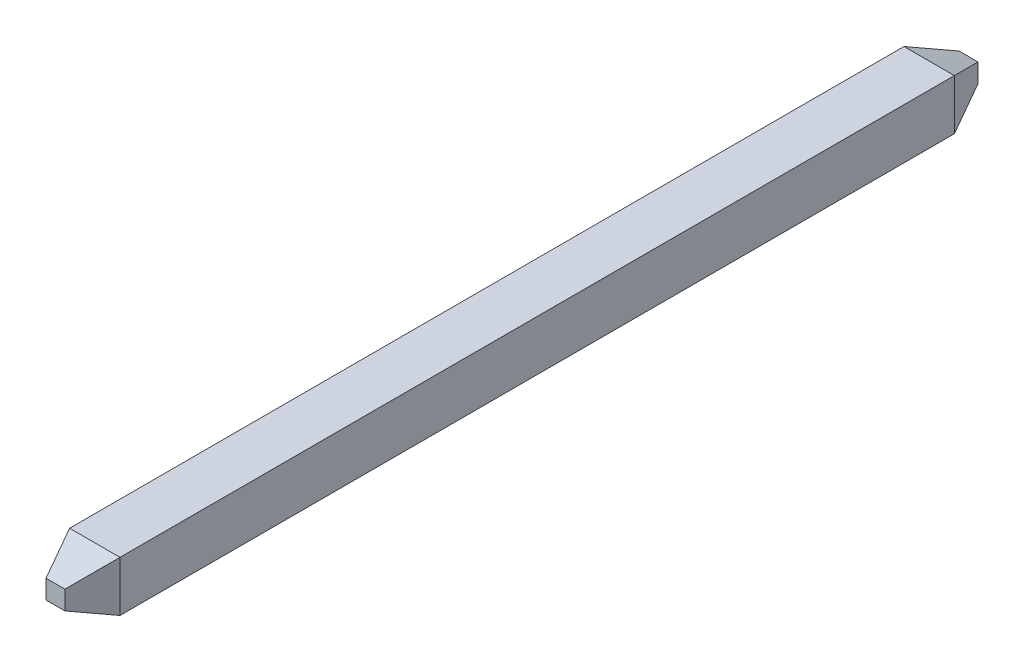
ISO-10303-21;
HEADER;
FILE_DESCRIPTION(('STEP AP214'),'2;1');
FILE_NAME('part.step','',(''),(''),'','','');
FILE_SCHEMA(('AUTOMOTIVE_DESIGN { 1 0 10303 214 1 1 1 1 }'));
ENDSEC;
DATA;
#1=APPLICATION_CONTEXT('core data for automotive mechanical design processes');
#2=APPLICATION_PROTOCOL_DEFINITION('international standard','automotive_design',2000,#1);
#3=PRODUCT_CONTEXT('',#1,'mechanical');
#4=PRODUCT('Part','Part','',(#3));
#5=PRODUCT_RELATED_PRODUCT_CATEGORY('part','',(#4));
#6=PRODUCT_DEFINITION_FORMATION('','',#4);
#7=PRODUCT_DEFINITION_CONTEXT('part definition',#1,'design');
#8=PRODUCT_DEFINITION('design','',#6,#7);
#9=PRODUCT_DEFINITION_SHAPE('','',#8);
#10=(LENGTH_UNIT() NAMED_UNIT(*) SI_UNIT(.MILLI.,.METRE.));
#11=(NAMED_UNIT(*) PLANE_ANGLE_UNIT() SI_UNIT($,.RADIAN.));
#12=(NAMED_UNIT(*) SI_UNIT($,.STERADIAN.) SOLID_ANGLE_UNIT());
#13=UNCERTAINTY_MEASURE_WITH_UNIT(LENGTH_MEASURE(1.E-05),#10,'distance_accuracy_value','');
#14=(GEOMETRIC_REPRESENTATION_CONTEXT(3) GLOBAL_UNCERTAINTY_ASSIGNED_CONTEXT((#13)) GLOBAL_UNIT_ASSIGNED_CONTEXT((#10,
#11,#12)) REPRESENTATION_CONTEXT('',''));
#15=CARTESIAN_POINT('',(0.,0.,0.));
#16=DIRECTION('',(0.,0.,1.));
#17=DIRECTION('',(1.,0.,0.));
#18=AXIS2_PLACEMENT_3D('',#15,#16,#17);
#19=CARTESIAN_POINT('',(0.12,0.,-5.8));
#20=DIRECTION('',(-0.928476690885259,0.,0.371390676354104));
#21=DIRECTION('',(0.371390676354104,0.,0.928476690885259));
#22=AXIS2_PLACEMENT_3D('',#19,#20,#21);
#23=PLANE('',#22);
#24=DIRECTION('',(0.,1.,0.));
#25=VECTOR('',#24,1.);
#26=CARTESIAN_POINT('',(0.32,0.32,-5.3));
#27=LINE('',#26,#25);
#28=CARTESIAN_POINT('',(0.32,-0.32,-5.3));
#29=VERTEX_POINT('',#28);
#30=CARTESIAN_POINT('',(0.32,0.32,-5.3));
#31=VERTEX_POINT('',#30);
#32=EDGE_CURVE('E104',#29,#31,#27,.T.);
#33=ORIENTED_EDGE('',*,*,#32,.F.);
#34=DIRECTION('',(-0.348155311911396,0.348155311911396,-0.870388279778489));
#35=VECTOR('',#34,1.);
#36=CARTESIAN_POINT('',(0.32,-0.32,-5.3));
#37=LINE('',#36,#35);
#38=CARTESIAN_POINT('',(0.12,-0.12,-5.8));
#39=VERTEX_POINT('',#38);
#40=EDGE_CURVE('E79',#29,#39,#37,.T.);
#41=ORIENTED_EDGE('',*,*,#40,.T.);
#42=DIRECTION('',(0.,1.,0.));
#43=VECTOR('',#42,1.);
#44=CARTESIAN_POINT('',(0.12,0.,-5.8));
#45=LINE('',#44,#43);
#46=CARTESIAN_POINT('',(0.12,0.12,-5.8));
#47=VERTEX_POINT('',#46);
#48=EDGE_CURVE('E20',#47,#39,#45,.F.);
#49=ORIENTED_EDGE('',*,*,#48,.F.);
#50=DIRECTION('',(0.348155311911396,0.348155311911396,0.870388279778489));
#51=VECTOR('',#50,1.);
#52=CARTESIAN_POINT('',(0.12,0.12,-5.8));
#53=LINE('',#52,#51);
#54=EDGE_CURVE('E83',#47,#31,#53,.T.);
#55=ORIENTED_EDGE('',*,*,#54,.T.);
#56=EDGE_LOOP('',(#33,#41,#49,#55));
#57=FACE_BOUND('',#56,.T.);
#58=ADVANCED_FACE('F17',(#57),#23,.F.);
#59=CARTESIAN_POINT('',(0.32,0.32,5.3));
#60=DIRECTION('',(0.928476690885259,0.,0.371390676354104));
#61=DIRECTION('',(0.371390676354104,0.,-0.928476690885259));
#62=AXIS2_PLACEMENT_3D('',#59,#60,#61);
#63=PLANE('',#62);
#64=DIRECTION('',(-0.348155311911396,0.348155311911396,0.870388279778489));
#65=VECTOR('',#64,1.);
#66=CARTESIAN_POINT('',(0.32,-0.32,5.3));
#67=LINE('',#66,#65);
#68=CARTESIAN_POINT('',(0.32,-0.32,5.3));
#69=VERTEX_POINT('',#68);
#70=CARTESIAN_POINT('',(0.12,-0.12,5.8));
#71=VERTEX_POINT('',#70);
#72=EDGE_CURVE('E109',#69,#71,#67,.T.);
#73=ORIENTED_EDGE('',*,*,#72,.F.);
#74=DIRECTION('',(0.,1.,0.));
#75=VECTOR('',#74,1.);
#76=CARTESIAN_POINT('',(0.32,0.32,5.3));
#77=LINE('',#76,#75);
#78=CARTESIAN_POINT('',(0.32,0.32,5.3));
#79=VERTEX_POINT('',#78);
#80=EDGE_CURVE('E106',#79,#69,#77,.F.);
#81=ORIENTED_EDGE('',*,*,#80,.F.);
#82=DIRECTION('',(0.348155311911396,0.348155311911396,-0.870388279778489));
#83=VECTOR('',#82,1.);
#84=CARTESIAN_POINT('',(0.12,0.12,5.8));
#85=LINE('',#84,#83);
#86=CARTESIAN_POINT('',(0.12,0.12,5.8));
#87=VERTEX_POINT('',#86);
#88=EDGE_CURVE('E116',#87,#79,#85,.T.);
#89=ORIENTED_EDGE('',*,*,#88,.F.);
#90=DIRECTION('',(0.,1.,0.));
#91=VECTOR('',#90,1.);
#92=CARTESIAN_POINT('',(0.12,0.,5.8));
#93=LINE('',#92,#91);
#94=EDGE_CURVE('E112',#87,#71,#93,.F.);
#95=ORIENTED_EDGE('',*,*,#94,.T.);
#96=EDGE_LOOP('',(#73,#81,#89,#95));
#97=FACE_BOUND('',#96,.T.);
#98=ADVANCED_FACE('F182',(#97),#63,.T.);
#99=CARTESIAN_POINT('',(0.,0.,-5.8));
#100=DIRECTION('',(0.,0.,-1.));
#101=DIRECTION('',(-1.,0.,0.));
#102=AXIS2_PLACEMENT_3D('',#99,#100,#101);
#103=PLANE('',#102);
#104=DIRECTION('',(1.,0.,0.));
#105=VECTOR('',#104,1.);
#106=CARTESIAN_POINT('',(0.,-0.12,-5.8));
#107=LINE('',#106,#105);
#108=CARTESIAN_POINT('',(-0.12,-0.12,-5.8));
#109=VERTEX_POINT('',#108);
#110=EDGE_CURVE('E100',#39,#109,#107,.F.);
#111=ORIENTED_EDGE('',*,*,#110,.T.);
#112=DIRECTION('',(0.,1.,0.));
#113=VECTOR('',#112,1.);
#114=CARTESIAN_POINT('',(-0.12,0.,-5.8));
#115=LINE('',#114,#113);
#116=CARTESIAN_POINT('',(-0.12,0.12,-5.8));
#117=VERTEX_POINT('',#116);
#118=EDGE_CURVE('E91',#109,#117,#115,.T.);
#119=ORIENTED_EDGE('',*,*,#118,.T.);
#120=DIRECTION('',(1.,0.,0.));
#121=VECTOR('',#120,1.);
#122=CARTESIAN_POINT('',(0.,0.12,-5.8));
#123=LINE('',#122,#121);
#124=EDGE_CURVE('E87',#117,#47,#123,.T.);
#125=ORIENTED_EDGE('',*,*,#124,.T.);
#126=ORIENTED_EDGE('',*,*,#48,.T.);
#127=EDGE_LOOP('',(#111,#119,#125,#126));
#128=FACE_BOUND('',#127,.T.);
#129=ADVANCED_FACE('F89',(#128),#103,.T.);
#130=CARTESIAN_POINT('',(0.,0.12,-5.8));
#131=DIRECTION('',(0.,-0.928476690885259,0.371390676354104));
#132=DIRECTION('',(0.,-0.371390676354104,-0.928476690885259));
#133=AXIS2_PLACEMENT_3D('',#130,#131,#132);
#134=PLANE('',#133);
#135=DIRECTION('',(1.,0.,0.));
#136=VECTOR('',#135,1.);
#137=CARTESIAN_POINT('',(-0.32,0.32,-5.3));
#138=LINE('',#137,#136);
#139=CARTESIAN_POINT('',(-0.32,0.32,-5.3));
#140=VERTEX_POINT('',#139);
#141=EDGE_CURVE('E97',#31,#140,#138,.F.);
#142=ORIENTED_EDGE('',*,*,#141,.F.);
#143=ORIENTED_EDGE('',*,*,#54,.F.);
#144=ORIENTED_EDGE('',*,*,#124,.F.);
#145=DIRECTION('',(-0.348155311911396,0.348155311911396,0.870388279778489));
#146=VECTOR('',#145,1.);
#147=CARTESIAN_POINT('',(-0.12,0.12,-5.8));
#148=LINE('',#147,#146);
#149=EDGE_CURVE('E129',#117,#140,#148,.T.);
#150=ORIENTED_EDGE('',*,*,#149,.T.);
#151=EDGE_LOOP('',(#142,#143,#144,#150));
#152=FACE_BOUND('',#151,.T.);
#153=ADVANCED_FACE('F95',(#152),#134,.F.);
#154=CARTESIAN_POINT('',(0.,-0.12,-5.8));
#155=DIRECTION('',(0.,0.928476690885259,0.371390676354104));
#156=DIRECTION('',(0.,-0.371390676354104,0.928476690885259));
#157=AXIS2_PLACEMENT_3D('',#154,#155,#156);
#158=PLANE('',#157);
#159=ORIENTED_EDGE('',*,*,#110,.F.);
#160=ORIENTED_EDGE('',*,*,#40,.F.);
#161=DIRECTION('',(1.,0.,0.));
#162=VECTOR('',#161,1.);
#163=CARTESIAN_POINT('',(0.32,-0.32,-5.3));
#164=LINE('',#163,#162);
#165=CARTESIAN_POINT('',(-0.32,-0.32,-5.3));
#166=VERTEX_POINT('',#165);
#167=EDGE_CURVE('E134',#166,#29,#164,.T.);
#168=ORIENTED_EDGE('',*,*,#167,.F.);
#169=DIRECTION('',(0.348155311911396,0.348155311911396,-0.870388279778489));
#170=VECTOR('',#169,1.);
#171=CARTESIAN_POINT('',(-0.32,-0.32,-5.3));
#172=LINE('',#171,#170);
#173=EDGE_CURVE('E131',#166,#109,#172,.T.);
#174=ORIENTED_EDGE('',*,*,#173,.T.);
#175=EDGE_LOOP('',(#159,#160,#168,#174));
#176=FACE_BOUND('',#175,.T.);
#177=ADVANCED_FACE('F178',(#176),#158,.F.);
#178=CARTESIAN_POINT('',(0.32,0.32,5.8));
#179=DIRECTION('',(1.,0.,0.));
#180=DIRECTION('',(0.,0.,-1.));
#181=AXIS2_PLACEMENT_3D('',#178,#179,#180);
#182=PLANE('',#181);
#183=DIRECTION('',(0.,0.,1.));
#184=VECTOR('',#183,1.);
#185=CARTESIAN_POINT('',(0.32,0.32,5.8));
#186=LINE('',#185,#184);
#187=EDGE_CURVE('E122',#79,#31,#186,.F.);
#188=ORIENTED_EDGE('',*,*,#187,.F.);
#189=ORIENTED_EDGE('',*,*,#80,.T.);
#190=DIRECTION('',(0.,0.,-1.));
#191=VECTOR('',#190,1.);
#192=CARTESIAN_POINT('',(0.32,-0.32,5.8));
#193=LINE('',#192,#191);
#194=EDGE_CURVE('E137',#29,#69,#193,.F.);
#195=ORIENTED_EDGE('',*,*,#194,.F.);
#196=ORIENTED_EDGE('',*,*,#32,.T.);
#197=EDGE_LOOP('',(#188,#189,#195,#196));
#198=FACE_BOUND('',#197,.T.);
#199=ADVANCED_FACE('F180',(#198),#182,.T.);
#200=CARTESIAN_POINT('',(0.32,-0.32,5.3));
#201=DIRECTION('',(0.,-0.928476690885259,0.371390676354104));
#202=DIRECTION('',(0.,-0.371390676354104,-0.928476690885259));
#203=AXIS2_PLACEMENT_3D('',#200,#201,#202);
#204=PLANE('',#203);
#205=DIRECTION('',(0.348155311911396,0.348155311911396,0.870388279778489));
#206=VECTOR('',#205,1.);
#207=CARTESIAN_POINT('',(-0.32,-0.32,5.3));
#208=LINE('',#207,#206);
#209=CARTESIAN_POINT('',(-0.32,-0.32,5.3));
#210=VERTEX_POINT('',#209);
#211=CARTESIAN_POINT('',(-0.12,-0.12,5.8));
#212=VERTEX_POINT('',#211);
#213=EDGE_CURVE('E35',#210,#212,#208,.T.);
#214=ORIENTED_EDGE('',*,*,#213,.F.);
#215=DIRECTION('',(1.,0.,0.));
#216=VECTOR('',#215,1.);
#217=CARTESIAN_POINT('',(0.32,-0.32,5.3));
#218=LINE('',#217,#216);
#219=EDGE_CURVE('E140',#69,#210,#218,.F.);
#220=ORIENTED_EDGE('',*,*,#219,.F.);
#221=ORIENTED_EDGE('',*,*,#72,.T.);
#222=DIRECTION('',(-1.,0.,0.));
#223=VECTOR('',#222,1.);
#224=CARTESIAN_POINT('',(0.,-0.12,5.8));
#225=LINE('',#224,#223);
#226=EDGE_CURVE('E114',#71,#212,#225,.T.);
#227=ORIENTED_EDGE('',*,*,#226,.T.);
#228=EDGE_LOOP('',(#214,#220,#221,#227));
#229=FACE_BOUND('',#228,.T.);
#230=ADVANCED_FACE('F185',(#229),#204,.T.);
#231=CARTESIAN_POINT('',(0.,0.,5.8));
#232=DIRECTION('',(0.,0.,-1.));
#233=DIRECTION('',(-1.,0.,0.));
#234=AXIS2_PLACEMENT_3D('',#231,#232,#233);
#235=PLANE('',#234);
#236=DIRECTION('',(0.,1.,0.));
#237=VECTOR('',#236,1.);
#238=CARTESIAN_POINT('',(-0.12,-0.32,5.8));
#239=LINE('',#238,#237);
#240=CARTESIAN_POINT('',(-0.12,0.12,5.8));
#241=VERTEX_POINT('',#240);
#242=EDGE_CURVE('E143',#212,#241,#239,.T.);
#243=ORIENTED_EDGE('',*,*,#242,.F.);
#244=ORIENTED_EDGE('',*,*,#226,.F.);
#245=ORIENTED_EDGE('',*,*,#94,.F.);
#246=DIRECTION('',(1.,0.,0.));
#247=VECTOR('',#246,1.);
#248=CARTESIAN_POINT('',(-0.32,0.12,5.8));
#249=LINE('',#248,#247);
#250=EDGE_CURVE('E119',#241,#87,#249,.T.);
#251=ORIENTED_EDGE('',*,*,#250,.F.);
#252=EDGE_LOOP('',(#243,#244,#245,#251));
#253=FACE_BOUND('',#252,.T.);
#254=ADVANCED_FACE('F187',(#253),#235,.F.);
#255=CARTESIAN_POINT('',(-0.32,0.32,5.3));
#256=DIRECTION('',(0.,0.928476690885259,0.371390676354104));
#257=DIRECTION('',(0.,-0.371390676354104,0.928476690885259));
#258=AXIS2_PLACEMENT_3D('',#255,#256,#257);
#259=PLANE('',#258);
#260=DIRECTION('',(-0.348155311911396,0.348155311911396,-0.870388279778489));
#261=VECTOR('',#260,1.);
#262=CARTESIAN_POINT('',(-0.12,0.12,5.8));
#263=LINE('',#262,#261);
#264=CARTESIAN_POINT('',(-0.32,0.32,5.3));
#265=VERTEX_POINT('',#264);
#266=EDGE_CURVE('E146',#241,#265,#263,.T.);
#267=ORIENTED_EDGE('',*,*,#266,.F.);
#268=ORIENTED_EDGE('',*,*,#250,.T.);
#269=ORIENTED_EDGE('',*,*,#88,.T.);
#270=DIRECTION('',(1.,0.,0.));
#271=VECTOR('',#270,1.);
#272=CARTESIAN_POINT('',(-0.32,0.32,5.3));
#273=LINE('',#272,#271);
#274=EDGE_CURVE('E125',#265,#79,#273,.T.);
#275=ORIENTED_EDGE('',*,*,#274,.F.);
#276=EDGE_LOOP('',(#267,#268,#269,#275));
#277=FACE_BOUND('',#276,.T.);
#278=ADVANCED_FACE('F169',(#277),#259,.T.);
#279=CARTESIAN_POINT('',(-0.32,0.32,5.8));
#280=DIRECTION('',(0.,1.,0.));
#281=DIRECTION('',(0.,0.,1.));
#282=AXIS2_PLACEMENT_3D('',#279,#280,#281);
#283=PLANE('',#282);
#284=DIRECTION('',(0.,0.,1.));
#285=VECTOR('',#284,1.);
#286=CARTESIAN_POINT('',(-0.32,0.32,5.8));
#287=LINE('',#286,#285);
#288=EDGE_CURVE('E149',#265,#140,#287,.F.);
#289=ORIENTED_EDGE('',*,*,#288,.F.);
#290=ORIENTED_EDGE('',*,*,#274,.T.);
#291=ORIENTED_EDGE('',*,*,#187,.T.);
#292=ORIENTED_EDGE('',*,*,#141,.T.);
#293=EDGE_LOOP('',(#289,#290,#291,#292));
#294=FACE_BOUND('',#293,.T.);
#295=ADVANCED_FACE('F172',(#294),#283,.T.);
#296=CARTESIAN_POINT('',(-0.12,0.,-5.8));
#297=DIRECTION('',(0.928476690885259,0.,0.371390676354104));
#298=DIRECTION('',(0.371390676354104,0.,-0.928476690885259));
#299=AXIS2_PLACEMENT_3D('',#296,#297,#298);
#300=PLANE('',#299);
#301=DIRECTION('',(0.,1.,0.));
#302=VECTOR('',#301,1.);
#303=CARTESIAN_POINT('',(-0.32,-0.32,-5.3));
#304=LINE('',#303,#302);
#305=EDGE_CURVE('E152',#140,#166,#304,.F.);
#306=ORIENTED_EDGE('',*,*,#305,.F.);
#307=ORIENTED_EDGE('',*,*,#149,.F.);
#308=ORIENTED_EDGE('',*,*,#118,.F.);
#309=ORIENTED_EDGE('',*,*,#173,.F.);
#310=EDGE_LOOP('',(#306,#307,#308,#309));
#311=FACE_BOUND('',#310,.T.);
#312=ADVANCED_FACE('F176',(#311),#300,.F.);
#313=CARTESIAN_POINT('',(0.32,-0.32,5.8));
#314=DIRECTION('',(0.,-1.,0.));
#315=DIRECTION('',(0.,0.,-1.));
#316=AXIS2_PLACEMENT_3D('',#313,#314,#315);
#317=PLANE('',#316);
#318=ORIENTED_EDGE('',*,*,#194,.T.);
#319=ORIENTED_EDGE('',*,*,#219,.T.);
#320=DIRECTION('',(0.,0.,1.));
#321=VECTOR('',#320,1.);
#322=CARTESIAN_POINT('',(-0.32,-0.32,5.8));
#323=LINE('',#322,#321);
#324=EDGE_CURVE('E26',#166,#210,#323,.T.);
#325=ORIENTED_EDGE('',*,*,#324,.F.);
#326=ORIENTED_EDGE('',*,*,#167,.T.);
#327=EDGE_LOOP('',(#318,#319,#325,#326));
#328=FACE_BOUND('',#327,.T.);
#329=ADVANCED_FACE('F162',(#328),#317,.T.);
#330=CARTESIAN_POINT('',(-0.32,-0.32,5.3));
#331=DIRECTION('',(-0.928476690885259,0.,0.371390676354104));
#332=DIRECTION('',(0.371390676354104,0.,0.928476690885259));
#333=AXIS2_PLACEMENT_3D('',#330,#331,#332);
#334=PLANE('',#333);
#335=ORIENTED_EDGE('',*,*,#266,.T.);
#336=DIRECTION('',(0.,1.,0.));
#337=VECTOR('',#336,1.);
#338=CARTESIAN_POINT('',(-0.32,-0.32,5.3));
#339=LINE('',#338,#337);
#340=EDGE_CURVE('E11',#210,#265,#339,.T.);
#341=ORIENTED_EDGE('',*,*,#340,.F.);
#342=ORIENTED_EDGE('',*,*,#213,.T.);
#343=ORIENTED_EDGE('',*,*,#242,.T.);
#344=EDGE_LOOP('',(#335,#341,#342,#343));
#345=FACE_BOUND('',#344,.T.);
#346=ADVANCED_FACE('F165',(#345),#334,.T.);
#347=CARTESIAN_POINT('',(-0.32,-0.32,5.8));
#348=DIRECTION('',(-1.,0.,0.));
#349=DIRECTION('',(0.,0.,1.));
#350=AXIS2_PLACEMENT_3D('',#347,#348,#349);
#351=PLANE('',#350);
#352=ORIENTED_EDGE('',*,*,#324,.T.);
#353=ORIENTED_EDGE('',*,*,#340,.T.);
#354=ORIENTED_EDGE('',*,*,#288,.T.);
#355=ORIENTED_EDGE('',*,*,#305,.T.);
#356=EDGE_LOOP('',(#352,#353,#354,#355));
#357=FACE_BOUND('',#356,.T.);
#358=ADVANCED_FACE('F158',(#357),#351,.T.);
#359=CLOSED_SHELL('',(#58,#98,#129,#153,#177,#199,#230,#254,#278,#295,#312,#329,#346,#358));
#360=MANIFOLD_SOLID_BREP('B1',#359);
#361=ADVANCED_BREP_SHAPE_REPRESENTATION('',(#18,#360),#14);
#362=SHAPE_DEFINITION_REPRESENTATION(#9,#361);
ENDSEC;
END-ISO-10303-21;
